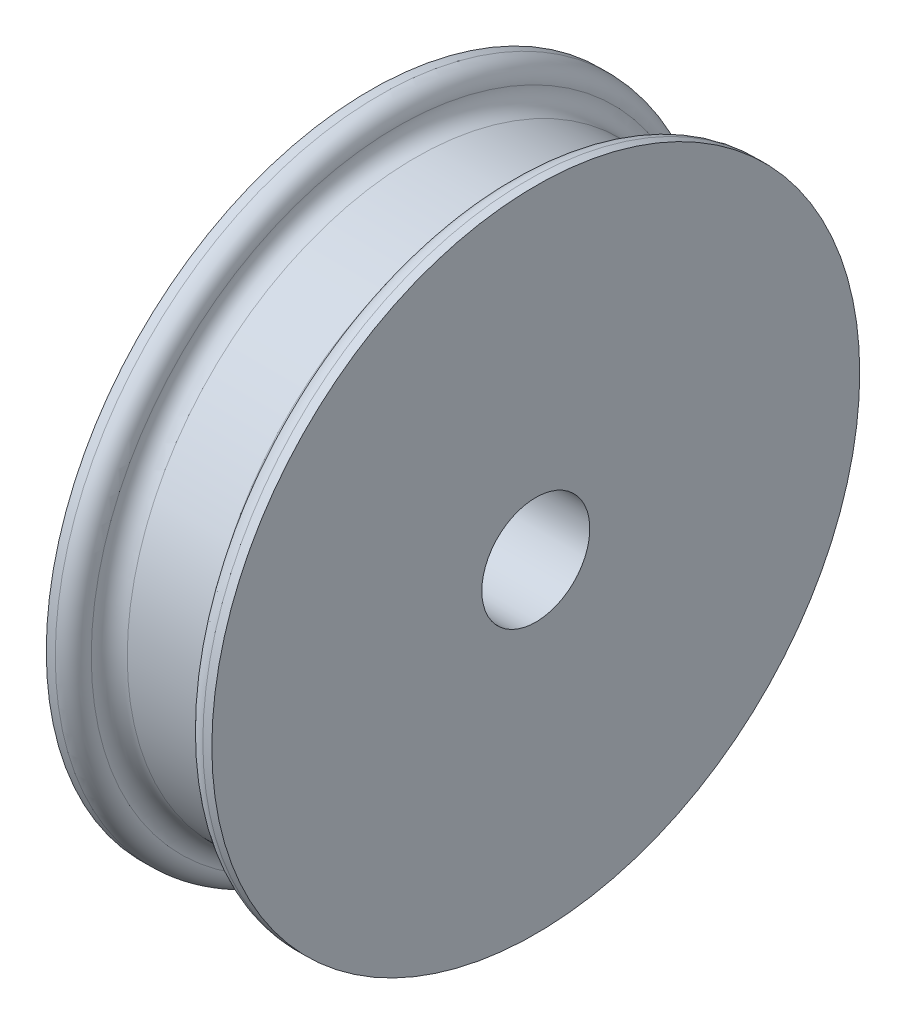
ISO-10303-21;
HEADER;
FILE_DESCRIPTION(('STEP AP214'),'2;1');
FILE_NAME('part.step','',(''),(''),'','','');
FILE_SCHEMA(('AUTOMOTIVE_DESIGN { 1 0 10303 214 1 1 1 1 }'));
ENDSEC;
DATA;
#1=APPLICATION_CONTEXT('core data for automotive mechanical design processes');
#2=APPLICATION_PROTOCOL_DEFINITION('international standard','automotive_design',2000,#1);
#3=PRODUCT_CONTEXT('',#1,'mechanical');
#4=PRODUCT('Part','Part','',(#3));
#5=PRODUCT_RELATED_PRODUCT_CATEGORY('part','',(#4));
#6=PRODUCT_DEFINITION_FORMATION('','',#4);
#7=PRODUCT_DEFINITION_CONTEXT('part definition',#1,'design');
#8=PRODUCT_DEFINITION('design','',#6,#7);
#9=PRODUCT_DEFINITION_SHAPE('','',#8);
#10=(LENGTH_UNIT() NAMED_UNIT(*) SI_UNIT(.MILLI.,.METRE.));
#11=(NAMED_UNIT(*) PLANE_ANGLE_UNIT() SI_UNIT($,.RADIAN.));
#12=(NAMED_UNIT(*) SI_UNIT($,.STERADIAN.) SOLID_ANGLE_UNIT());
#13=UNCERTAINTY_MEASURE_WITH_UNIT(LENGTH_MEASURE(1.E-05),#10,'distance_accuracy_value','');
#14=(GEOMETRIC_REPRESENTATION_CONTEXT(3) GLOBAL_UNCERTAINTY_ASSIGNED_CONTEXT((#13)) GLOBAL_UNIT_ASSIGNED_CONTEXT((#10,
#11,#12)) REPRESENTATION_CONTEXT('',''));
#15=CARTESIAN_POINT('',(0.,0.,0.));
#16=DIRECTION('',(0.,0.,1.));
#17=DIRECTION('',(1.,0.,0.));
#18=AXIS2_PLACEMENT_3D('',#15,#16,#17);
#19=CARTESIAN_POINT('',(2.3,1.5,0.));
#20=DIRECTION('',(-1.,0.,0.));
#21=DIRECTION('',(0.,0.,1.));
#22=AXIS2_PLACEMENT_3D('',#19,#20,#21);
#23=PLANE('',#22);
#24=CARTESIAN_POINT('',(2.3,0.,0.));
#25=DIRECTION('',(-1.,0.,0.));
#26=DIRECTION('',(0.,0.,1.));
#27=AXIS2_PLACEMENT_3D('',#24,#25,#26);
#28=CIRCLE('',#27,9.);
#29=CARTESIAN_POINT('',(2.3,0.,9.));
#30=VERTEX_POINT('',#29);
#31=EDGE_CURVE('E79',#30,#30,#28,.T.);
#32=ORIENTED_EDGE('',*,*,#31,.F.);
#33=EDGE_LOOP('',(#32));
#34=FACE_BOUND('',#33,.T.);
#35=CARTESIAN_POINT('',(2.3,0.,0.));
#36=DIRECTION('',(-1.,0.,0.));
#37=DIRECTION('',(0.,0.,1.));
#38=AXIS2_PLACEMENT_3D('',#35,#36,#37);
#39=CIRCLE('',#38,1.5);
#40=CARTESIAN_POINT('',(2.3,0.,1.5));
#41=VERTEX_POINT('',#40);
#42=EDGE_CURVE('E55',#41,#41,#39,.T.);
#43=ORIENTED_EDGE('',*,*,#42,.T.);
#44=EDGE_LOOP('',(#43));
#45=FACE_BOUND('',#44,.T.);
#46=ADVANCED_FACE('F44',(#34,#45),#23,.F.);
#47=CARTESIAN_POINT('',(0.,0.,0.));
#48=DIRECTION('',(-1.,0.,0.));
#49=DIRECTION('',(0.,0.,1.));
#50=AXIS2_PLACEMENT_3D('',#47,#48,#49);
#51=CYLINDRICAL_SURFACE('',#50,1.5);
#52=ORIENTED_EDGE('',*,*,#42,.F.);
#53=EDGE_LOOP('',(#52));
#54=FACE_BOUND('',#53,.T.);
#55=CARTESIAN_POINT('',(-2.3,0.,0.));
#56=DIRECTION('',(-1.,0.,0.));
#57=DIRECTION('',(0.,0.,1.));
#58=AXIS2_PLACEMENT_3D('',#55,#56,#57);
#59=CIRCLE('',#58,1.5);
#60=CARTESIAN_POINT('',(-2.3,0.,1.5));
#61=VERTEX_POINT('',#60);
#62=EDGE_CURVE('E59',#61,#61,#59,.T.);
#63=ORIENTED_EDGE('',*,*,#62,.T.);
#64=EDGE_LOOP('',(#63));
#65=FACE_BOUND('',#64,.T.);
#66=ADVANCED_FACE('F87',(#54,#65),#51,.F.);
#67=CARTESIAN_POINT('',(-2.3,1.5,0.));
#68=DIRECTION('',(1.,0.,0.));
#69=DIRECTION('',(0.,0.,-1.));
#70=AXIS2_PLACEMENT_3D('',#67,#68,#69);
#71=PLANE('',#70);
#72=ORIENTED_EDGE('',*,*,#62,.F.);
#73=EDGE_LOOP('',(#72));
#74=FACE_BOUND('',#73,.T.);
#75=CARTESIAN_POINT('',(-2.3,0.,0.));
#76=DIRECTION('',(-1.,0.,0.));
#77=DIRECTION('',(0.,0.,1.));
#78=AXIS2_PLACEMENT_3D('',#75,#76,#77);
#79=CIRCLE('',#78,9.);
#80=CARTESIAN_POINT('',(-2.3,0.,9.));
#81=VERTEX_POINT('',#80);
#82=EDGE_CURVE('E64',#81,#81,#79,.T.);
#83=ORIENTED_EDGE('',*,*,#82,.T.);
#84=EDGE_LOOP('',(#83));
#85=FACE_BOUND('',#84,.T.);
#86=ADVANCED_FACE('F93',(#74,#85),#71,.F.);
#87=CARTESIAN_POINT('',(0.,0.,0.));
#88=DIRECTION('',(-1.,0.,0.));
#89=DIRECTION('',(0.,0.,1.));
#90=AXIS2_PLACEMENT_3D('',#87,#88,#89);
#91=CYLINDRICAL_SURFACE('',#90,9.);
#92=CARTESIAN_POINT('',(-2.05,0.,0.));
#93=DIRECTION('',(-1.,0.,0.));
#94=DIRECTION('',(0.,0.,1.));
#95=AXIS2_PLACEMENT_3D('',#92,#93,#94);
#96=CIRCLE('',#95,9.);
#97=CARTESIAN_POINT('',(-2.05,0.,9.));
#98=VERTEX_POINT('',#97);
#99=EDGE_CURVE('E51',#98,#98,#96,.T.);
#100=ORIENTED_EDGE('',*,*,#99,.T.);
#101=EDGE_LOOP('',(#100));
#102=FACE_BOUND('',#101,.T.);
#103=ORIENTED_EDGE('',*,*,#82,.F.);
#104=EDGE_LOOP('',(#103));
#105=FACE_BOUND('',#104,.T.);
#106=ADVANCED_FACE('F99',(#102,#105),#91,.T.);
#107=CARTESIAN_POINT('',(-1.05,0.,0.));
#108=DIRECTION('',(-1.,0.,0.));
#109=DIRECTION('',(0.,0.,1.));
#110=AXIS2_PLACEMENT_3D('',#107,#108,#109);
#111=TOROIDAL_SURFACE('',#110,8.5,0.5);
#112=CARTESIAN_POINT('',(-1.55,0.,0.));
#113=DIRECTION('',(-1.,0.,0.));
#114=DIRECTION('',(0.,0.,1.));
#115=AXIS2_PLACEMENT_3D('',#112,#113,#114);
#116=CIRCLE('',#115,8.5);
#117=CARTESIAN_POINT('',(-1.55,0.,8.5));
#118=VERTEX_POINT('',#117);
#119=EDGE_CURVE('E67',#118,#118,#116,.T.);
#120=ORIENTED_EDGE('',*,*,#119,.F.);
#121=EDGE_LOOP('',(#120));
#122=FACE_BOUND('',#121,.T.);
#123=CARTESIAN_POINT('',(-1.05,0.,0.));
#124=DIRECTION('',(-1.,0.,0.));
#125=DIRECTION('',(0.,0.,1.));
#126=AXIS2_PLACEMENT_3D('',#123,#124,#125);
#127=CIRCLE('',#126,8.);
#128=CARTESIAN_POINT('',(-1.05,0.,8.));
#129=VERTEX_POINT('',#128);
#130=EDGE_CURVE('E70',#129,#129,#127,.T.);
#131=ORIENTED_EDGE('',*,*,#130,.T.);
#132=EDGE_LOOP('',(#131));
#133=FACE_BOUND('',#132,.T.);
#134=ADVANCED_FACE('F104',(#122,#133),#111,.F.);
#135=CARTESIAN_POINT('',(0.,0.,0.));
#136=DIRECTION('',(-1.,0.,0.));
#137=DIRECTION('',(0.,0.,1.));
#138=AXIS2_PLACEMENT_3D('',#135,#136,#137);
#139=CYLINDRICAL_SURFACE('',#138,8.);
#140=ORIENTED_EDGE('',*,*,#130,.F.);
#141=EDGE_LOOP('',(#140));
#142=FACE_BOUND('',#141,.T.);
#143=CARTESIAN_POINT('',(1.05,0.,0.));
#144=DIRECTION('',(-1.,0.,0.));
#145=DIRECTION('',(0.,0.,1.));
#146=AXIS2_PLACEMENT_3D('',#143,#144,#145);
#147=CIRCLE('',#146,8.);
#148=CARTESIAN_POINT('',(1.05,0.,8.));
#149=VERTEX_POINT('',#148);
#150=EDGE_CURVE('E73',#149,#149,#147,.T.);
#151=ORIENTED_EDGE('',*,*,#150,.T.);
#152=EDGE_LOOP('',(#151));
#153=FACE_BOUND('',#152,.T.);
#154=ADVANCED_FACE('F109',(#142,#153),#139,.T.);
#155=CARTESIAN_POINT('',(1.05,0.,0.));
#156=DIRECTION('',(-1.,0.,0.));
#157=DIRECTION('',(0.,0.,1.));
#158=AXIS2_PLACEMENT_3D('',#155,#156,#157);
#159=TOROIDAL_SURFACE('',#158,8.5,0.5);
#160=ORIENTED_EDGE('',*,*,#150,.F.);
#161=EDGE_LOOP('',(#160));
#162=FACE_BOUND('',#161,.T.);
#163=CARTESIAN_POINT('',(1.55,0.,0.));
#164=DIRECTION('',(-1.,0.,0.));
#165=DIRECTION('',(0.,0.,1.));
#166=AXIS2_PLACEMENT_3D('',#163,#164,#165);
#167=CIRCLE('',#166,8.5);
#168=CARTESIAN_POINT('',(1.55,0.,8.5));
#169=VERTEX_POINT('',#168);
#170=EDGE_CURVE('E76',#169,#169,#167,.T.);
#171=ORIENTED_EDGE('',*,*,#170,.T.);
#172=EDGE_LOOP('',(#171));
#173=FACE_BOUND('',#172,.T.);
#174=ADVANCED_FACE('F121',(#162,#173),#159,.F.);
#175=CARTESIAN_POINT('',(0.,0.,0.));
#176=DIRECTION('',(-1.,0.,0.));
#177=DIRECTION('',(0.,0.,1.));
#178=AXIS2_PLACEMENT_3D('',#175,#176,#177);
#179=CYLINDRICAL_SURFACE('',#178,9.);
#180=CARTESIAN_POINT('',(2.05,0.,0.));
#181=DIRECTION('',(1.,0.,0.));
#182=DIRECTION('',(0.,0.,-1.));
#183=AXIS2_PLACEMENT_3D('',#180,#181,#182);
#184=CIRCLE('',#183,9.);
#185=CARTESIAN_POINT('',(2.05,0.,-9.));
#186=VERTEX_POINT('',#185);
#187=EDGE_CURVE('E12',#186,#186,#184,.T.);
#188=ORIENTED_EDGE('',*,*,#187,.T.);
#189=EDGE_LOOP('',(#188));
#190=FACE_BOUND('',#189,.T.);
#191=ORIENTED_EDGE('',*,*,#31,.T.);
#192=EDGE_LOOP('',(#191));
#193=FACE_BOUND('',#192,.T.);
#194=ADVANCED_FACE('F83',(#190,#193),#179,.T.);
#195=CARTESIAN_POINT('',(-2.05,0.,0.));
#196=DIRECTION('',(-1.,0.,0.));
#197=DIRECTION('',(0.,0.,1.));
#198=AXIS2_PLACEMENT_3D('',#195,#196,#197);
#199=TOROIDAL_SURFACE('',#198,8.5,0.5);
#200=ORIENTED_EDGE('',*,*,#119,.T.);
#201=EDGE_LOOP('',(#200));
#202=FACE_BOUND('',#201,.T.);
#203=ORIENTED_EDGE('',*,*,#99,.F.);
#204=EDGE_LOOP('',(#203));
#205=FACE_BOUND('',#204,.T.);
#206=ADVANCED_FACE('F113',(#202,#205),#199,.T.);
#207=CARTESIAN_POINT('',(2.05,0.,0.));
#208=DIRECTION('',(1.,0.,0.));
#209=DIRECTION('',(0.,0.,-1.));
#210=AXIS2_PLACEMENT_3D('',#207,#208,#209);
#211=TOROIDAL_SURFACE('',#210,8.5,0.5);
#212=ORIENTED_EDGE('',*,*,#187,.F.);
#213=EDGE_LOOP('',(#212));
#214=FACE_BOUND('',#213,.T.);
#215=ORIENTED_EDGE('',*,*,#170,.F.);
#216=EDGE_LOOP('',(#215));
#217=FACE_BOUND('',#216,.T.);
#218=ADVANCED_FACE('F46',(#214,#217),#211,.T.);
#219=CLOSED_SHELL('',(#46,#66,#86,#106,#134,#154,#174,#194,#206,#218));
#220=MANIFOLD_SOLID_BREP('B2',#219);
#221=ADVANCED_BREP_SHAPE_REPRESENTATION('',(#18,#220),#14);
#222=SHAPE_DEFINITION_REPRESENTATION(#9,#221);
ENDSEC;
END-ISO-10303-21;
